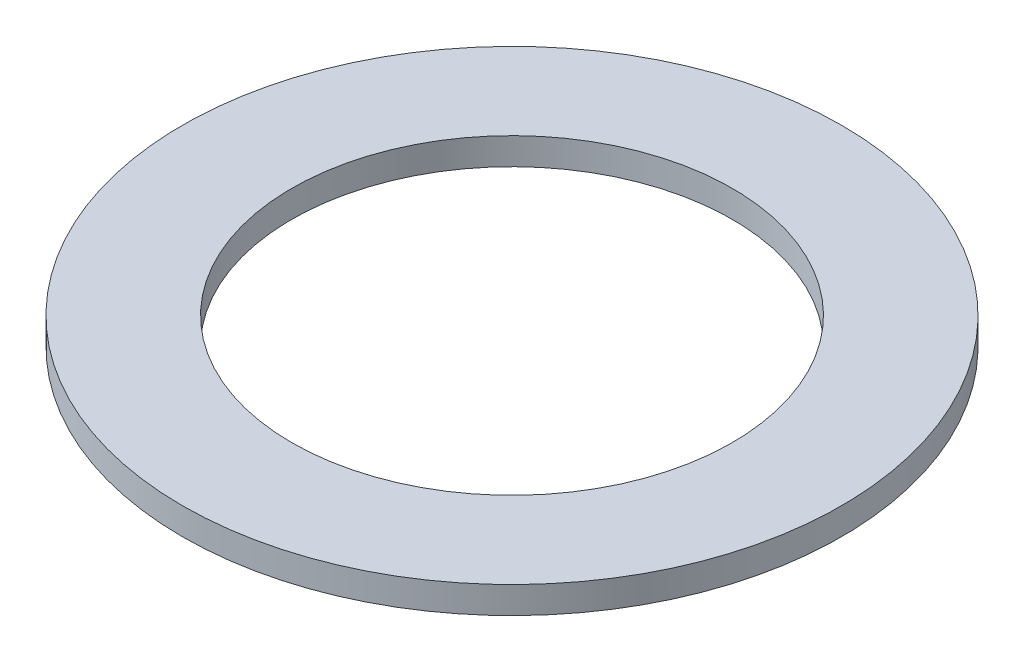
ISO-10303-21;
HEADER;
FILE_DESCRIPTION(('STEP AP214'),'2;1');
FILE_NAME('part.step','',(''),(''),'','','');
FILE_SCHEMA(('AUTOMOTIVE_DESIGN { 1 0 10303 214 1 1 1 1 }'));
ENDSEC;
DATA;
#1=APPLICATION_CONTEXT('core data for automotive mechanical design processes');
#2=APPLICATION_PROTOCOL_DEFINITION('international standard','automotive_design',2000,#1);
#3=PRODUCT_CONTEXT('',#1,'mechanical');
#4=PRODUCT('Part','Part','',(#3));
#5=PRODUCT_RELATED_PRODUCT_CATEGORY('part','',(#4));
#6=PRODUCT_DEFINITION_FORMATION('','',#4);
#7=PRODUCT_DEFINITION_CONTEXT('part definition',#1,'design');
#8=PRODUCT_DEFINITION('design','',#6,#7);
#9=PRODUCT_DEFINITION_SHAPE('','',#8);
#10=(LENGTH_UNIT() NAMED_UNIT(*) SI_UNIT(.MILLI.,.METRE.));
#11=(NAMED_UNIT(*) PLANE_ANGLE_UNIT() SI_UNIT($,.RADIAN.));
#12=(NAMED_UNIT(*) SI_UNIT($,.STERADIAN.) SOLID_ANGLE_UNIT());
#13=UNCERTAINTY_MEASURE_WITH_UNIT(LENGTH_MEASURE(1.E-05),#10,'distance_accuracy_value','');
#14=(GEOMETRIC_REPRESENTATION_CONTEXT(3) GLOBAL_UNCERTAINTY_ASSIGNED_CONTEXT((#13)) GLOBAL_UNIT_ASSIGNED_CONTEXT((#10,
#11,#12)) REPRESENTATION_CONTEXT('',''));
#15=CARTESIAN_POINT('',(0.,0.,0.));
#16=DIRECTION('',(0.,0.,1.));
#17=DIRECTION('',(1.,0.,0.));
#18=AXIS2_PLACEMENT_3D('',#15,#16,#17);
#19=CARTESIAN_POINT('',(0.,1.,0.));
#20=DIRECTION('',(0.,1.,0.));
#21=DIRECTION('',(0.,0.,1.));
#22=AXIS2_PLACEMENT_3D('',#19,#20,#21);
#23=PLANE('',#22);
#24=CARTESIAN_POINT('',(0.,1.,0.));
#25=DIRECTION('',(0.,1.,0.));
#26=DIRECTION('',(0.,0.,1.));
#27=AXIS2_PLACEMENT_3D('',#24,#25,#26);
#28=CIRCLE('',#27,12.25);
#29=CARTESIAN_POINT('',(0.,1.,12.25));
#30=VERTEX_POINT('',#29);
#31=EDGE_CURVE('E10',#30,#30,#28,.T.);
#32=ORIENTED_EDGE('',*,*,#31,.T.);
#33=EDGE_LOOP('',(#32));
#34=FACE_BOUND('',#33,.T.);
#35=CARTESIAN_POINT('',(0.,1.,0.));
#36=DIRECTION('',(0.,1.,0.));
#37=DIRECTION('',(0.,0.,1.));
#38=AXIS2_PLACEMENT_3D('',#35,#36,#37);
#39=CIRCLE('',#38,8.1875);
#40=CARTESIAN_POINT('',(0.,1.,8.1875));
#41=VERTEX_POINT('',#40);
#42=EDGE_CURVE('E54',#41,#41,#39,.T.);
#43=ORIENTED_EDGE('',*,*,#42,.F.);
#44=EDGE_LOOP('',(#43));
#45=FACE_BOUND('',#44,.T.);
#46=ADVANCED_FACE('F41',(#34,#45),#23,.T.);
#47=CARTESIAN_POINT('',(0.,0.,0.));
#48=DIRECTION('',(0.,1.,0.));
#49=DIRECTION('',(0.,0.,1.));
#50=AXIS2_PLACEMENT_3D('',#47,#48,#49);
#51=PLANE('',#50);
#52=CARTESIAN_POINT('',(0.,0.,0.));
#53=DIRECTION('',(0.,1.,0.));
#54=DIRECTION('',(0.,0.,1.));
#55=AXIS2_PLACEMENT_3D('',#52,#53,#54);
#56=CIRCLE('',#55,12.25);
#57=CARTESIAN_POINT('',(0.,0.,12.25));
#58=VERTEX_POINT('',#57);
#59=EDGE_CURVE('E45',#58,#58,#56,.T.);
#60=ORIENTED_EDGE('',*,*,#59,.F.);
#61=EDGE_LOOP('',(#60));
#62=FACE_BOUND('',#61,.T.);
#63=CARTESIAN_POINT('',(0.,0.,0.));
#64=DIRECTION('',(0.,1.,0.));
#65=DIRECTION('',(0.,0.,1.));
#66=AXIS2_PLACEMENT_3D('',#63,#64,#65);
#67=CIRCLE('',#66,8.1875);
#68=CARTESIAN_POINT('',(0.,0.,8.1875));
#69=VERTEX_POINT('',#68);
#70=EDGE_CURVE('E56',#69,#69,#67,.T.);
#71=ORIENTED_EDGE('',*,*,#70,.T.);
#72=EDGE_LOOP('',(#71));
#73=FACE_BOUND('',#72,.T.);
#74=ADVANCED_FACE('F68',(#62,#73),#51,.F.);
#75=CARTESIAN_POINT('',(0.,1.,0.));
#76=DIRECTION('',(0.,-1.,0.));
#77=DIRECTION('',(0.,0.,-1.));
#78=AXIS2_PLACEMENT_3D('',#75,#76,#77);
#79=CYLINDRICAL_SURFACE('',#78,12.25);
#80=ORIENTED_EDGE('',*,*,#31,.F.);
#81=EDGE_LOOP('',(#80));
#82=FACE_BOUND('',#81,.T.);
#83=ORIENTED_EDGE('',*,*,#59,.T.);
#84=EDGE_LOOP('',(#83));
#85=FACE_BOUND('',#84,.T.);
#86=ADVANCED_FACE('F43',(#82,#85),#79,.T.);
#87=CARTESIAN_POINT('',(0.,1.,0.));
#88=DIRECTION('',(0.,-1.,0.));
#89=DIRECTION('',(0.,0.,-1.));
#90=AXIS2_PLACEMENT_3D('',#87,#88,#89);
#91=CYLINDRICAL_SURFACE('',#90,8.1875);
#92=ORIENTED_EDGE('',*,*,#42,.T.);
#93=EDGE_LOOP('',(#92));
#94=FACE_BOUND('',#93,.T.);
#95=ORIENTED_EDGE('',*,*,#70,.F.);
#96=EDGE_LOOP('',(#95));
#97=FACE_BOUND('',#96,.T.);
#98=ADVANCED_FACE('F64',(#94,#97),#91,.F.);
#99=CLOSED_SHELL('',(#46,#74,#86,#98));
#100=MANIFOLD_SOLID_BREP('B2',#99);
#101=ADVANCED_BREP_SHAPE_REPRESENTATION('',(#18,#100),#14);
#102=SHAPE_DEFINITION_REPRESENTATION(#9,#101);
ENDSEC;
END-ISO-10303-21;
